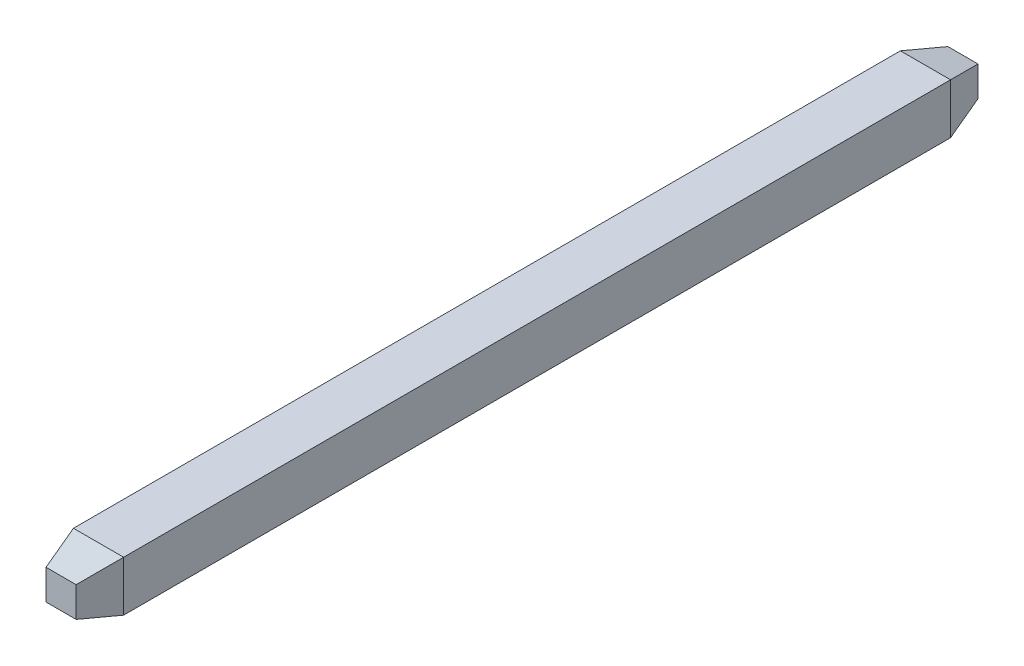
ISO-10303-21;
HEADER;
FILE_DESCRIPTION(('STEP AP214'),'2;1');
FILE_NAME('part.step','',(''),(''),'','','');
FILE_SCHEMA(('AUTOMOTIVE_DESIGN { 1 0 10303 214 1 1 1 1 }'));
ENDSEC;
DATA;
#1=APPLICATION_CONTEXT('core data for automotive mechanical design processes');
#2=APPLICATION_PROTOCOL_DEFINITION('international standard','automotive_design',2000,#1);
#3=PRODUCT_CONTEXT('',#1,'mechanical');
#4=PRODUCT('Part','Part','',(#3));
#5=PRODUCT_RELATED_PRODUCT_CATEGORY('part','',(#4));
#6=PRODUCT_DEFINITION_FORMATION('','',#4);
#7=PRODUCT_DEFINITION_CONTEXT('part definition',#1,'design');
#8=PRODUCT_DEFINITION('design','',#6,#7);
#9=PRODUCT_DEFINITION_SHAPE('','',#8);
#10=(LENGTH_UNIT() NAMED_UNIT(*) SI_UNIT(.MILLI.,.METRE.));
#11=(NAMED_UNIT(*) PLANE_ANGLE_UNIT() SI_UNIT($,.RADIAN.));
#12=(NAMED_UNIT(*) SI_UNIT($,.STERADIAN.) SOLID_ANGLE_UNIT());
#13=UNCERTAINTY_MEASURE_WITH_UNIT(LENGTH_MEASURE(1.E-05),#10,'distance_accuracy_value','');
#14=(GEOMETRIC_REPRESENTATION_CONTEXT(3) GLOBAL_UNCERTAINTY_ASSIGNED_CONTEXT((#13)) GLOBAL_UNIT_ASSIGNED_CONTEXT((#10,
#11,#12)) REPRESENTATION_CONTEXT('',''));
#15=CARTESIAN_POINT('',(0.,0.,0.));
#16=DIRECTION('',(0.,0.,1.));
#17=DIRECTION('',(1.,0.,0.));
#18=AXIS2_PLACEMENT_3D('',#15,#16,#17);
#19=CARTESIAN_POINT('',(8.62859499326237,2.21999999999985,7.92229749663118));
#20=DIRECTION('',(0.,-0.965925826289069,0.25881904510252));
#21=DIRECTION('',(0.,-0.25881904510252,-0.965925826289069));
#22=AXIS2_PLACEMENT_3D('',#19,#20,#21);
#23=PLANE('',#22);
#24=DIRECTION('',(1.,0.,0.));
#25=VECTOR('',#24,1.);
#26=CARTESIAN_POINT('',(10.16,2.34799999999985,8.4));
#27=LINE('',#26,#25);
#28=CARTESIAN_POINT('',(9.968,2.34799999999985,8.4));
#29=VERTEX_POINT('',#28);
#30=CARTESIAN_POINT('',(10.352,2.34799999999985,8.4));
#31=VERTEX_POINT('',#30);
#32=EDGE_CURVE('E20',#29,#31,#27,.T.);
#33=ORIENTED_EDGE('',*,*,#32,.F.);
#34=DIRECTION('',(0.250562807085732,0.25056280708573,0.93511312653103));
#35=VECTOR('',#34,1.);
#36=CARTESIAN_POINT('',(9.84,2.21999999999985,7.92229749663118));
#37=LINE('',#36,#35);
#38=CARTESIAN_POINT('',(9.84,2.21999999999985,7.92229749663118));
#39=VERTEX_POINT('',#38);
#40=EDGE_CURVE('E110',#39,#29,#37,.T.);
#41=ORIENTED_EDGE('',*,*,#40,.F.);
#42=DIRECTION('',(1.,0.,0.));
#43=VECTOR('',#42,1.);
#44=CARTESIAN_POINT('',(9.84,2.21999999999985,7.92229749663118));
#45=LINE('',#44,#43);
#46=CARTESIAN_POINT('',(10.48,2.21999999999985,7.92229749663118));
#47=VERTEX_POINT('',#46);
#48=EDGE_CURVE('E96',#47,#39,#45,.F.);
#49=ORIENTED_EDGE('',*,*,#48,.F.);
#50=DIRECTION('',(0.250562807085731,-0.250562807085748,-0.935113126531025));
#51=VECTOR('',#50,1.);
#52=CARTESIAN_POINT('',(10.352,2.34799999999986,8.4));
#53=LINE('',#52,#51);
#54=EDGE_CURVE('E94',#31,#47,#53,.T.);
#55=ORIENTED_EDGE('',*,*,#54,.F.);
#56=EDGE_LOOP('',(#33,#41,#49,#55));
#57=FACE_BOUND('',#56,.T.);
#58=ADVANCED_FACE('F17',(#57),#23,.T.);
#59=CARTESIAN_POINT('',(8.62859499326237,2.21999999999985,-2.62229749663118));
#60=DIRECTION('',(0.,0.965925826289068,0.258819045102521));
#61=DIRECTION('',(0.,-0.258819045102521,0.965925826289068));
#62=AXIS2_PLACEMENT_3D('',#59,#60,#61);
#63=PLANE('',#62);
#64=DIRECTION('',(0.250562807085732,0.25056280708573,-0.93511312653103));
#65=VECTOR('',#64,1.);
#66=CARTESIAN_POINT('',(9.84,2.21999999999985,-2.62229749663118));
#67=LINE('',#66,#65);
#68=CARTESIAN_POINT('',(9.84,2.21999999999985,-2.62229749663118));
#69=VERTEX_POINT('',#68);
#70=CARTESIAN_POINT('',(9.968,2.34799999999985,-3.1));
#71=VERTEX_POINT('',#70);
#72=EDGE_CURVE('E113',#69,#71,#67,.T.);
#73=ORIENTED_EDGE('',*,*,#72,.T.);
#74=DIRECTION('',(1.,0.,0.));
#75=VECTOR('',#74,1.);
#76=CARTESIAN_POINT('',(10.16,2.34799999999985,-3.1));
#77=LINE('',#76,#75);
#78=CARTESIAN_POINT('',(10.352,2.34799999999985,-3.1));
#79=VERTEX_POINT('',#78);
#80=EDGE_CURVE('E79',#71,#79,#77,.T.);
#81=ORIENTED_EDGE('',*,*,#80,.T.);
#82=DIRECTION('',(0.250562807085731,-0.250562807085748,0.935113126531025));
#83=VECTOR('',#82,1.);
#84=CARTESIAN_POINT('',(10.352,2.34799999999986,-3.1));
#85=LINE('',#84,#83);
#86=CARTESIAN_POINT('',(10.48,2.21999999999985,-2.62229749663118));
#87=VERTEX_POINT('',#86);
#88=EDGE_CURVE('E108',#79,#87,#85,.T.);
#89=ORIENTED_EDGE('',*,*,#88,.T.);
#90=DIRECTION('',(1.,0.,0.));
#91=VECTOR('',#90,1.);
#92=CARTESIAN_POINT('',(9.84,2.21999999999985,-2.62229749663118));
#93=LINE('',#92,#91);
#94=EDGE_CURVE('E118',#69,#87,#93,.T.);
#95=ORIENTED_EDGE('',*,*,#94,.F.);
#96=EDGE_LOOP('',(#73,#81,#89,#95));
#97=FACE_BOUND('',#96,.T.);
#98=ADVANCED_FACE('F281',(#97),#63,.F.);
#99=CARTESIAN_POINT('',(10.16,2.53999999999985,8.4));
#100=DIRECTION('',(0.,0.,1.));
#101=DIRECTION('',(1.,0.,0.));
#102=AXIS2_PLACEMENT_3D('',#99,#100,#101);
#103=PLANE('',#102);
#104=ORIENTED_EDGE('',*,*,#32,.T.);
#105=DIRECTION('',(0.,1.,0.));
#106=VECTOR('',#105,1.);
#107=CARTESIAN_POINT('',(10.352,1.00859499326222,8.4));
#108=LINE('',#107,#106);
#109=CARTESIAN_POINT('',(10.352,2.73199999999985,8.4));
#110=VERTEX_POINT('',#109);
#111=EDGE_CURVE('E88',#110,#31,#108,.F.);
#112=ORIENTED_EDGE('',*,*,#111,.F.);
#113=DIRECTION('',(1.,0.,0.));
#114=VECTOR('',#113,1.);
#115=CARTESIAN_POINT('',(11.6914050067376,2.73199999999985,8.4));
#116=LINE('',#115,#114);
#117=CARTESIAN_POINT('',(9.968,2.73199999999985,8.4));
#118=VERTEX_POINT('',#117);
#119=EDGE_CURVE('E124',#118,#110,#116,.T.);
#120=ORIENTED_EDGE('',*,*,#119,.F.);
#121=DIRECTION('',(0.,1.,0.));
#122=VECTOR('',#121,1.);
#123=CARTESIAN_POINT('',(9.968,4.07140500673748,8.4));
#124=LINE('',#123,#122);
#125=EDGE_CURVE('E90',#29,#118,#124,.T.);
#126=ORIENTED_EDGE('',*,*,#125,.F.);
#127=EDGE_LOOP('',(#104,#112,#120,#126));
#128=FACE_BOUND('',#127,.T.);
#129=ADVANCED_FACE('F85',(#128),#103,.T.);
#130=CARTESIAN_POINT('',(10.48,1.00859499326222,7.92229749663118));
#131=DIRECTION('',(0.965925826289069,0.,0.25881904510252));
#132=DIRECTION('',(0.25881904510252,0.,-0.965925826289069));
#133=AXIS2_PLACEMENT_3D('',#130,#131,#132);
#134=PLANE('',#133);
#135=ORIENTED_EDGE('',*,*,#111,.T.);
#136=ORIENTED_EDGE('',*,*,#54,.T.);
#137=DIRECTION('',(0.,1.,0.));
#138=VECTOR('',#137,1.);
#139=CARTESIAN_POINT('',(10.48,2.21999999999985,7.92229749663118));
#140=LINE('',#139,#138);
#141=CARTESIAN_POINT('',(10.48,2.85999999999985,7.92229749663118));
#142=VERTEX_POINT('',#141);
#143=EDGE_CURVE('E127',#142,#47,#140,.F.);
#144=ORIENTED_EDGE('',*,*,#143,.F.);
#145=DIRECTION('',(0.250562807085732,0.25056280708573,-0.93511312653103));
#146=VECTOR('',#145,1.);
#147=CARTESIAN_POINT('',(10.352,2.73199999999985,8.4));
#148=LINE('',#147,#146);
#149=EDGE_CURVE('E102',#110,#142,#148,.T.);
#150=ORIENTED_EDGE('',*,*,#149,.F.);
#151=EDGE_LOOP('',(#135,#136,#144,#150));
#152=FACE_BOUND('',#151,.T.);
#153=ADVANCED_FACE('F100',(#152),#134,.T.);
#154=CARTESIAN_POINT('',(10.16,2.53999999999985,-3.1));
#155=DIRECTION('',(0.,0.,1.));
#156=DIRECTION('',(1.,0.,0.));
#157=AXIS2_PLACEMENT_3D('',#154,#155,#156);
#158=PLANE('',#157);
#159=DIRECTION('',(0.,1.,0.));
#160=VECTOR('',#159,1.);
#161=CARTESIAN_POINT('',(10.352,1.00859499326222,-3.1));
#162=LINE('',#161,#160);
#163=CARTESIAN_POINT('',(10.352,2.73199999999985,-3.1));
#164=VERTEX_POINT('',#163);
#165=EDGE_CURVE('E106',#164,#79,#162,.F.);
#166=ORIENTED_EDGE('',*,*,#165,.T.);
#167=ORIENTED_EDGE('',*,*,#80,.F.);
#168=DIRECTION('',(0.,1.,0.));
#169=VECTOR('',#168,1.);
#170=CARTESIAN_POINT('',(9.968,4.07140500673748,-3.1));
#171=LINE('',#170,#169);
#172=CARTESIAN_POINT('',(9.968,2.73199999999985,-3.1));
#173=VERTEX_POINT('',#172);
#174=EDGE_CURVE('E115',#71,#173,#171,.T.);
#175=ORIENTED_EDGE('',*,*,#174,.T.);
#176=DIRECTION('',(1.,0.,0.));
#177=VECTOR('',#176,1.);
#178=CARTESIAN_POINT('',(11.6914050067376,2.73199999999985,-3.1));
#179=LINE('',#178,#177);
#180=EDGE_CURVE('E138',#173,#164,#179,.T.);
#181=ORIENTED_EDGE('',*,*,#180,.T.);
#182=EDGE_LOOP('',(#166,#167,#175,#181));
#183=FACE_BOUND('',#182,.T.);
#184=ADVANCED_FACE('F257',(#183),#158,.F.);
#185=CARTESIAN_POINT('',(10.48,1.00859499326222,-2.62229749663118));
#186=DIRECTION('',(-0.965925826289068,0.,0.258819045102521));
#187=DIRECTION('',(0.258819045102521,0.,0.965925826289068));
#188=AXIS2_PLACEMENT_3D('',#185,#186,#187);
#189=PLANE('',#188);
#190=ORIENTED_EDGE('',*,*,#88,.F.);
#191=ORIENTED_EDGE('',*,*,#165,.F.);
#192=DIRECTION('',(0.250562807085732,0.250562807085732,0.935113126531029));
#193=VECTOR('',#192,1.);
#194=CARTESIAN_POINT('',(10.352,2.73199999999985,-3.1));
#195=LINE('',#194,#193);
#196=CARTESIAN_POINT('',(10.48,2.85999999999985,-2.62229749663118));
#197=VERTEX_POINT('',#196);
#198=EDGE_CURVE('E140',#164,#197,#195,.T.);
#199=ORIENTED_EDGE('',*,*,#198,.T.);
#200=DIRECTION('',(0.,1.,0.));
#201=VECTOR('',#200,1.);
#202=CARTESIAN_POINT('',(10.48,2.21999999999985,-2.62229749663118));
#203=LINE('',#202,#201);
#204=EDGE_CURVE('E133',#87,#197,#203,.T.);
#205=ORIENTED_EDGE('',*,*,#204,.F.);
#206=EDGE_LOOP('',(#190,#191,#199,#205));
#207=FACE_BOUND('',#206,.T.);
#208=ADVANCED_FACE('F249',(#207),#189,.F.);
#209=CARTESIAN_POINT('',(9.84,4.07140500673748,7.92229749663118));
#210=DIRECTION('',(-0.965925826289069,0.,0.25881904510252));
#211=DIRECTION('',(0.25881904510252,0.,0.965925826289069));
#212=AXIS2_PLACEMENT_3D('',#209,#210,#211);
#213=PLANE('',#212);
#214=ORIENTED_EDGE('',*,*,#125,.T.);
#215=DIRECTION('',(0.250562807085729,-0.250562807085731,0.93511312653103));
#216=VECTOR('',#215,1.);
#217=CARTESIAN_POINT('',(9.84,2.85999999999985,7.92229749663118));
#218=LINE('',#217,#216);
#219=CARTESIAN_POINT('',(9.84,2.85999999999985,7.92229749663118));
#220=VERTEX_POINT('',#219);
#221=EDGE_CURVE('E121',#220,#118,#218,.T.);
#222=ORIENTED_EDGE('',*,*,#221,.F.);
#223=DIRECTION('',(0.,-1.,0.));
#224=VECTOR('',#223,1.);
#225=CARTESIAN_POINT('',(9.84,2.85999999999985,7.92229749663118));
#226=LINE('',#225,#224);
#227=EDGE_CURVE('E142',#39,#220,#226,.F.);
#228=ORIENTED_EDGE('',*,*,#227,.F.);
#229=ORIENTED_EDGE('',*,*,#40,.T.);
#230=EDGE_LOOP('',(#214,#222,#228,#229));
#231=FACE_BOUND('',#230,.T.);
#232=ADVANCED_FACE('F171',(#231),#213,.T.);
#233=CARTESIAN_POINT('',(9.84,4.07140500673748,-2.62229749663118));
#234=DIRECTION('',(0.965925826289068,0.,0.258819045102521));
#235=DIRECTION('',(0.258819045102521,0.,-0.965925826289068));
#236=AXIS2_PLACEMENT_3D('',#233,#234,#235);
#237=PLANE('',#236);
#238=DIRECTION('',(0.250562807085729,-0.250562807085732,-0.93511312653103));
#239=VECTOR('',#238,1.);
#240=CARTESIAN_POINT('',(9.84,2.85999999999985,-2.62229749663118));
#241=LINE('',#240,#239);
#242=CARTESIAN_POINT('',(9.84,2.85999999999985,-2.62229749663118));
#243=VERTEX_POINT('',#242);
#244=EDGE_CURVE('E136',#243,#173,#241,.T.);
#245=ORIENTED_EDGE('',*,*,#244,.T.);
#246=ORIENTED_EDGE('',*,*,#174,.F.);
#247=ORIENTED_EDGE('',*,*,#72,.F.);
#248=DIRECTION('',(0.,-1.,0.));
#249=VECTOR('',#248,1.);
#250=CARTESIAN_POINT('',(9.84,2.85999999999985,-2.62229749663118));
#251=LINE('',#250,#249);
#252=EDGE_CURVE('E35',#243,#69,#251,.T.);
#253=ORIENTED_EDGE('',*,*,#252,.F.);
#254=EDGE_LOOP('',(#245,#246,#247,#253));
#255=FACE_BOUND('',#254,.T.);
#256=ADVANCED_FACE('F188',(#255),#237,.F.);
#257=CARTESIAN_POINT('',(9.84,2.21999999999985,-3.1));
#258=DIRECTION('',(0.,-1.,0.));
#259=DIRECTION('',(1.,0.,0.));
#260=AXIS2_PLACEMENT_3D('',#257,#258,#259);
#261=PLANE('',#260);
#262=ORIENTED_EDGE('',*,*,#94,.T.);
#263=DIRECTION('',(0.,0.,1.));
#264=VECTOR('',#263,1.);
#265=CARTESIAN_POINT('',(10.48,2.21999999999985,-3.1));
#266=LINE('',#265,#264);
#267=EDGE_CURVE('E130',#47,#87,#266,.F.);
#268=ORIENTED_EDGE('',*,*,#267,.F.);
#269=ORIENTED_EDGE('',*,*,#48,.T.);
#270=DIRECTION('',(0.,0.,1.));
#271=VECTOR('',#270,1.);
#272=CARTESIAN_POINT('',(9.84,2.21999999999985,-3.1));
#273=LINE('',#272,#271);
#274=EDGE_CURVE('E146',#69,#39,#273,.T.);
#275=ORIENTED_EDGE('',*,*,#274,.F.);
#276=EDGE_LOOP('',(#262,#268,#269,#275));
#277=FACE_BOUND('',#276,.T.);
#278=ADVANCED_FACE('F174',(#277),#261,.T.);
#279=CARTESIAN_POINT('',(11.6914050067376,2.85999999999985,7.92229749663118));
#280=DIRECTION('',(0.,0.965925826289069,0.25881904510252));
#281=DIRECTION('',(0.,-0.25881904510252,0.965925826289069));
#282=AXIS2_PLACEMENT_3D('',#279,#280,#281);
#283=PLANE('',#282);
#284=ORIENTED_EDGE('',*,*,#119,.T.);
#285=ORIENTED_EDGE('',*,*,#149,.T.);
#286=DIRECTION('',(-1.,0.,0.));
#287=VECTOR('',#286,1.);
#288=CARTESIAN_POINT('',(10.48,2.85999999999985,7.92229749663118));
#289=LINE('',#288,#287);
#290=EDGE_CURVE('E149',#220,#142,#289,.F.);
#291=ORIENTED_EDGE('',*,*,#290,.F.);
#292=ORIENTED_EDGE('',*,*,#221,.T.);
#293=EDGE_LOOP('',(#284,#285,#291,#292));
#294=FACE_BOUND('',#293,.T.);
#295=ADVANCED_FACE('F179',(#294),#283,.T.);
#296=CARTESIAN_POINT('',(10.48,2.21999999999985,-3.1));
#297=DIRECTION('',(1.,0.,0.));
#298=DIRECTION('',(0.,1.,0.));
#299=AXIS2_PLACEMENT_3D('',#296,#297,#298);
#300=PLANE('',#299);
#301=ORIENTED_EDGE('',*,*,#204,.T.);
#302=DIRECTION('',(0.,0.,1.));
#303=VECTOR('',#302,1.);
#304=CARTESIAN_POINT('',(10.48,2.85999999999985,-3.1));
#305=LINE('',#304,#303);
#306=EDGE_CURVE('E152',#142,#197,#305,.F.);
#307=ORIENTED_EDGE('',*,*,#306,.F.);
#308=ORIENTED_EDGE('',*,*,#143,.T.);
#309=ORIENTED_EDGE('',*,*,#267,.T.);
#310=EDGE_LOOP('',(#301,#307,#308,#309));
#311=FACE_BOUND('',#310,.T.);
#312=ADVANCED_FACE('F177',(#311),#300,.T.);
#313=CARTESIAN_POINT('',(11.6914050067376,2.85999999999985,-2.62229749663118));
#314=DIRECTION('',(0.,-0.965925826289068,0.258819045102521));
#315=DIRECTION('',(0.,-0.258819045102521,-0.965925826289068));
#316=AXIS2_PLACEMENT_3D('',#313,#314,#315);
#317=PLANE('',#316);
#318=ORIENTED_EDGE('',*,*,#198,.F.);
#319=ORIENTED_EDGE('',*,*,#180,.F.);
#320=ORIENTED_EDGE('',*,*,#244,.F.);
#321=DIRECTION('',(-1.,0.,0.));
#322=VECTOR('',#321,1.);
#323=CARTESIAN_POINT('',(10.48,2.85999999999985,-2.62229749663118));
#324=LINE('',#323,#322);
#325=EDGE_CURVE('E26',#197,#243,#324,.T.);
#326=ORIENTED_EDGE('',*,*,#325,.F.);
#327=EDGE_LOOP('',(#318,#319,#320,#326));
#328=FACE_BOUND('',#327,.T.);
#329=ADVANCED_FACE('F163',(#328),#317,.F.);
#330=CARTESIAN_POINT('',(9.84,2.85999999999985,-3.1));
#331=DIRECTION('',(-1.,0.,0.));
#332=DIRECTION('',(0.,-1.,0.));
#333=AXIS2_PLACEMENT_3D('',#330,#331,#332);
#334=PLANE('',#333);
#335=ORIENTED_EDGE('',*,*,#252,.T.);
#336=ORIENTED_EDGE('',*,*,#274,.T.);
#337=ORIENTED_EDGE('',*,*,#227,.T.);
#338=DIRECTION('',(0.,0.,1.));
#339=VECTOR('',#338,1.);
#340=CARTESIAN_POINT('',(9.84,2.85999999999985,-3.1));
#341=LINE('',#340,#339);
#342=EDGE_CURVE('E11',#243,#220,#341,.T.);
#343=ORIENTED_EDGE('',*,*,#342,.F.);
#344=EDGE_LOOP('',(#335,#336,#337,#343));
#345=FACE_BOUND('',#344,.T.);
#346=ADVANCED_FACE('F167',(#345),#334,.T.);
#347=CARTESIAN_POINT('',(10.48,2.85999999999985,-3.1));
#348=DIRECTION('',(0.,1.,0.));
#349=DIRECTION('',(-1.,0.,0.));
#350=AXIS2_PLACEMENT_3D('',#347,#348,#349);
#351=PLANE('',#350);
#352=ORIENTED_EDGE('',*,*,#325,.T.);
#353=ORIENTED_EDGE('',*,*,#342,.T.);
#354=ORIENTED_EDGE('',*,*,#290,.T.);
#355=ORIENTED_EDGE('',*,*,#306,.T.);
#356=EDGE_LOOP('',(#352,#353,#354,#355));
#357=FACE_BOUND('',#356,.T.);
#358=ADVANCED_FACE('F158',(#357),#351,.T.);
#359=CLOSED_SHELL('',(#58,#98,#129,#153,#184,#208,#232,#256,#278,#295,#312,#329,#346,#358));
#360=MANIFOLD_SOLID_BREP('B1',#359);
#361=ADVANCED_BREP_SHAPE_REPRESENTATION('',(#18,#360),#14);
#362=SHAPE_DEFINITION_REPRESENTATION(#9,#361);
ENDSEC;
END-ISO-10303-21;
